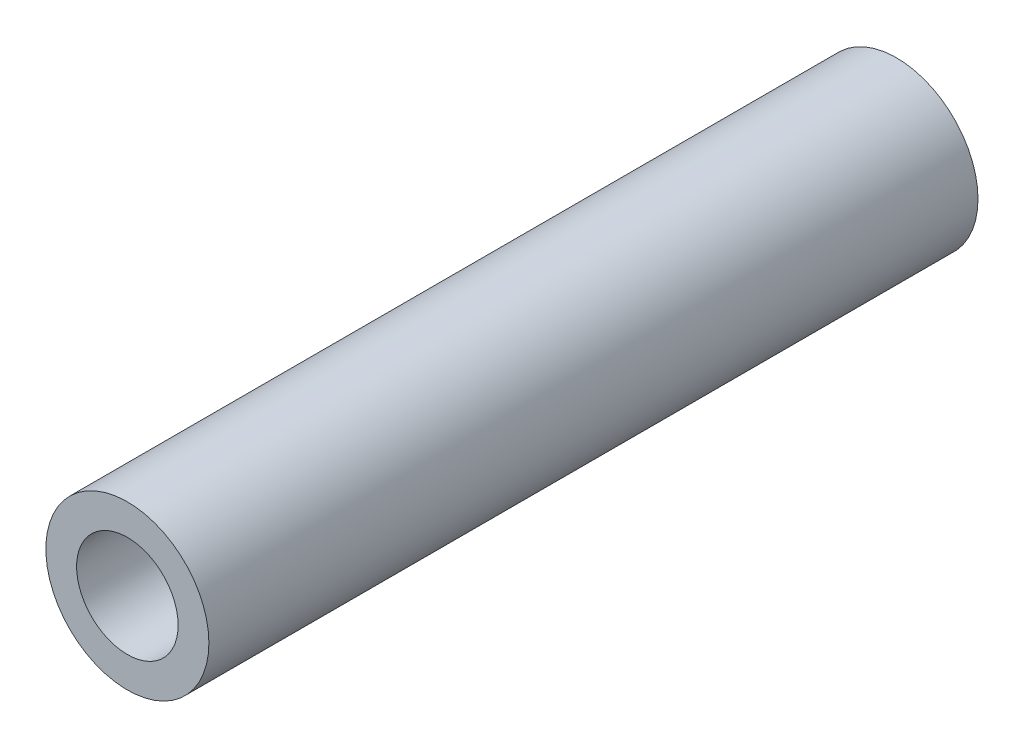
ISO-10303-21;
HEADER;
FILE_DESCRIPTION(('STEP AP214'),'2;1');
FILE_NAME('part.step','',(''),(''),'','','');
FILE_SCHEMA(('AUTOMOTIVE_DESIGN { 1 0 10303 214 1 1 1 1 }'));
ENDSEC;
DATA;
#1=APPLICATION_CONTEXT('core data for automotive mechanical design processes');
#2=APPLICATION_PROTOCOL_DEFINITION('international standard','automotive_design',2000,#1);
#3=PRODUCT_CONTEXT('',#1,'mechanical');
#4=PRODUCT('Part','Part','',(#3));
#5=PRODUCT_RELATED_PRODUCT_CATEGORY('part','',(#4));
#6=PRODUCT_DEFINITION_FORMATION('','',#4);
#7=PRODUCT_DEFINITION_CONTEXT('part definition',#1,'design');
#8=PRODUCT_DEFINITION('design','',#6,#7);
#9=PRODUCT_DEFINITION_SHAPE('','',#8);
#10=(LENGTH_UNIT() NAMED_UNIT(*) SI_UNIT(.MILLI.,.METRE.));
#11=(NAMED_UNIT(*) PLANE_ANGLE_UNIT() SI_UNIT($,.RADIAN.));
#12=(NAMED_UNIT(*) SI_UNIT($,.STERADIAN.) SOLID_ANGLE_UNIT());
#13=UNCERTAINTY_MEASURE_WITH_UNIT(LENGTH_MEASURE(1.E-05),#10,'distance_accuracy_value','');
#14=(GEOMETRIC_REPRESENTATION_CONTEXT(3) GLOBAL_UNCERTAINTY_ASSIGNED_CONTEXT((#13)) GLOBAL_UNIT_ASSIGNED_CONTEXT((#10,
#11,#12)) REPRESENTATION_CONTEXT('',''));
#15=CARTESIAN_POINT('',(0.,0.,0.));
#16=DIRECTION('',(0.,0.,1.));
#17=DIRECTION('',(1.,0.,0.));
#18=AXIS2_PLACEMENT_3D('',#15,#16,#17);
#19=CARTESIAN_POINT('',(0.,0.,25.));
#20=DIRECTION('',(0.,0.,1.));
#21=DIRECTION('',(1.,0.,0.));
#22=AXIS2_PLACEMENT_3D('',#19,#20,#21);
#23=PLANE('',#22);
#24=CARTESIAN_POINT('',(0.,0.,25.));
#25=DIRECTION('',(0.,0.,1.));
#26=DIRECTION('',(1.,0.,0.));
#27=AXIS2_PLACEMENT_3D('',#24,#25,#26);
#28=CIRCLE('',#27,2.65);
#29=CARTESIAN_POINT('',(2.65,0.,25.));
#30=VERTEX_POINT('',#29);
#31=EDGE_CURVE('E10',#30,#30,#28,.T.);
#32=ORIENTED_EDGE('',*,*,#31,.T.);
#33=EDGE_LOOP('',(#32));
#34=FACE_BOUND('',#33,.T.);
#35=CARTESIAN_POINT('',(0.,0.,25.));
#36=DIRECTION('',(0.,0.,1.));
#37=DIRECTION('',(1.,0.,0.));
#38=AXIS2_PLACEMENT_3D('',#35,#36,#37);
#39=CIRCLE('',#38,1.65);
#40=CARTESIAN_POINT('',(1.65,0.,25.));
#41=VERTEX_POINT('',#40);
#42=EDGE_CURVE('E50',#41,#41,#39,.T.);
#43=ORIENTED_EDGE('',*,*,#42,.F.);
#44=EDGE_LOOP('',(#43));
#45=FACE_BOUND('',#44,.T.);
#46=ADVANCED_FACE('F37',(#34,#45),#23,.T.);
#47=CARTESIAN_POINT('',(0.,0.,0.));
#48=DIRECTION('',(0.,0.,1.));
#49=DIRECTION('',(1.,0.,0.));
#50=AXIS2_PLACEMENT_3D('',#47,#48,#49);
#51=PLANE('',#50);
#52=CARTESIAN_POINT('',(0.,0.,0.));
#53=DIRECTION('',(0.,0.,1.));
#54=DIRECTION('',(1.,0.,0.));
#55=AXIS2_PLACEMENT_3D('',#52,#53,#54);
#56=CIRCLE('',#55,2.65);
#57=CARTESIAN_POINT('',(2.65,0.,0.));
#58=VERTEX_POINT('',#57);
#59=EDGE_CURVE('E41',#58,#58,#56,.T.);
#60=ORIENTED_EDGE('',*,*,#59,.F.);
#61=EDGE_LOOP('',(#60));
#62=FACE_BOUND('',#61,.T.);
#63=CARTESIAN_POINT('',(0.,0.,0.));
#64=DIRECTION('',(0.,0.,1.));
#65=DIRECTION('',(1.,0.,0.));
#66=AXIS2_PLACEMENT_3D('',#63,#64,#65);
#67=CIRCLE('',#66,1.65);
#68=CARTESIAN_POINT('',(1.65,0.,0.));
#69=VERTEX_POINT('',#68);
#70=EDGE_CURVE('E52',#69,#69,#67,.T.);
#71=ORIENTED_EDGE('',*,*,#70,.T.);
#72=EDGE_LOOP('',(#71));
#73=FACE_BOUND('',#72,.T.);
#74=ADVANCED_FACE('F64',(#62,#73),#51,.F.);
#75=CARTESIAN_POINT('',(0.,0.,25.));
#76=DIRECTION('',(0.,0.,-1.));
#77=DIRECTION('',(-1.,0.,0.));
#78=AXIS2_PLACEMENT_3D('',#75,#76,#77);
#79=CYLINDRICAL_SURFACE('',#78,2.65);
#80=ORIENTED_EDGE('',*,*,#31,.F.);
#81=EDGE_LOOP('',(#80));
#82=FACE_BOUND('',#81,.T.);
#83=ORIENTED_EDGE('',*,*,#59,.T.);
#84=EDGE_LOOP('',(#83));
#85=FACE_BOUND('',#84,.T.);
#86=ADVANCED_FACE('F39',(#82,#85),#79,.T.);
#87=CARTESIAN_POINT('',(0.,0.,25.));
#88=DIRECTION('',(0.,0.,-1.));
#89=DIRECTION('',(-1.,0.,0.));
#90=AXIS2_PLACEMENT_3D('',#87,#88,#89);
#91=CYLINDRICAL_SURFACE('',#90,1.65);
#92=ORIENTED_EDGE('',*,*,#42,.T.);
#93=EDGE_LOOP('',(#92));
#94=FACE_BOUND('',#93,.T.);
#95=ORIENTED_EDGE('',*,*,#70,.F.);
#96=EDGE_LOOP('',(#95));
#97=FACE_BOUND('',#96,.T.);
#98=ADVANCED_FACE('F60',(#94,#97),#91,.F.);
#99=CLOSED_SHELL('',(#46,#74,#86,#98));
#100=MANIFOLD_SOLID_BREP('B2',#99);
#101=ADVANCED_BREP_SHAPE_REPRESENTATION('',(#18,#100),#14);
#102=SHAPE_DEFINITION_REPRESENTATION(#9,#101);
ENDSEC;
END-ISO-10303-21;
